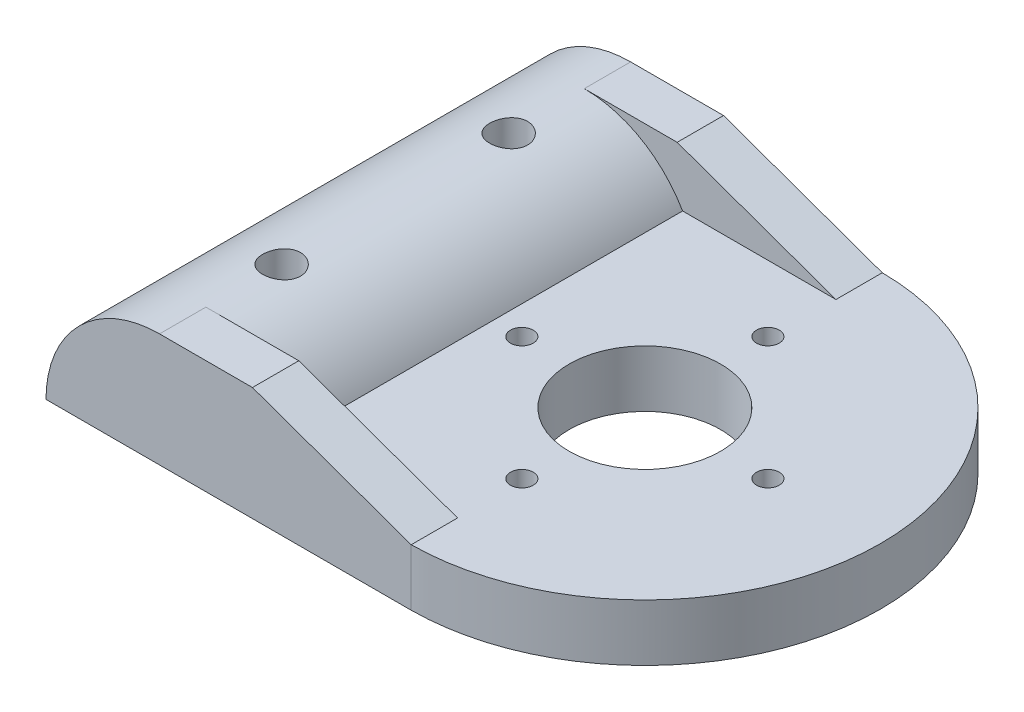
ISO-10303-21;
HEADER;
FILE_DESCRIPTION(('STEP AP214'),'2;1');
FILE_NAME('part.step','',(''),(''),'','','');
FILE_SCHEMA(('AUTOMOTIVE_DESIGN { 1 0 10303 214 1 1 1 1 }'));
ENDSEC;
DATA;
#1=APPLICATION_CONTEXT('core data for automotive mechanical design processes');
#2=APPLICATION_PROTOCOL_DEFINITION('international standard','automotive_design',2000,#1);
#3=PRODUCT_CONTEXT('',#1,'mechanical');
#4=PRODUCT('Part','Part','',(#3));
#5=PRODUCT_RELATED_PRODUCT_CATEGORY('part','',(#4));
#6=PRODUCT_DEFINITION_FORMATION('','',#4);
#7=PRODUCT_DEFINITION_CONTEXT('part definition',#1,'design');
#8=PRODUCT_DEFINITION('design','',#6,#7);
#9=PRODUCT_DEFINITION_SHAPE('','',#8);
#10=(LENGTH_UNIT() NAMED_UNIT(*) SI_UNIT(.MILLI.,.METRE.));
#11=(NAMED_UNIT(*) PLANE_ANGLE_UNIT() SI_UNIT($,.RADIAN.));
#12=(NAMED_UNIT(*) SI_UNIT($,.STERADIAN.) SOLID_ANGLE_UNIT());
#13=UNCERTAINTY_MEASURE_WITH_UNIT(LENGTH_MEASURE(1.E-05),#10,'distance_accuracy_value','');
#14=(GEOMETRIC_REPRESENTATION_CONTEXT(3) GLOBAL_UNCERTAINTY_ASSIGNED_CONTEXT((#13)) GLOBAL_UNIT_ASSIGNED_CONTEXT((#10,
#11,#12)) REPRESENTATION_CONTEXT('',''));
#15=CARTESIAN_POINT('',(0.,0.,0.));
#16=DIRECTION('',(0.,0.,1.));
#17=DIRECTION('',(1.,0.,0.));
#18=AXIS2_PLACEMENT_3D('',#15,#16,#17);
#19=CARTESIAN_POINT('',(4.11917536426009,3.,0.372218896237082));
#20=DIRECTION('',(0.,1.,0.));
#21=DIRECTION('',(0.,0.,1.));
#22=AXIS2_PLACEMENT_3D('',#19,#20,#21);
#23=PLANE('',#22);
#24=CARTESIAN_POINT('',(4.11842239450041,3.,-6.1284034925885));
#25=DIRECTION('',(0.,1.,0.));
#26=DIRECTION('',(0.,0.,1.));
#27=AXIS2_PLACEMENT_3D('',#24,#25,#26);
#28=CIRCLE('',#27,0.599999867802697);
#29=CARTESIAN_POINT('',(4.11842239450041,3.,-5.5284036247858));
#30=VERTEX_POINT('',#29);
#31=EDGE_CURVE('E189',#30,#30,#28,.T.);
#32=ORIENTED_EDGE('',*,*,#31,.F.);
#33=EDGE_LOOP('',(#32));
#34=FACE_BOUND('',#33,.T.);
#35=CARTESIAN_POINT('',(4.11917536426009,3.,0.372218896237082));
#36=DIRECTION('',(0.,1.,0.));
#37=DIRECTION('',(0.,0.,1.));
#38=AXIS2_PLACEMENT_3D('',#35,#36,#37);
#39=CIRCLE('',#38,3.99942615782216);
#40=CARTESIAN_POINT('',(4.11917536426009,3.,4.37164505405924));
#41=VERTEX_POINT('',#40);
#42=EDGE_CURVE('E197',#41,#41,#39,.T.);
#43=ORIENTED_EDGE('',*,*,#42,.F.);
#44=EDGE_LOOP('',(#43));
#45=FACE_BOUND('',#44,.T.);
#46=CARTESIAN_POINT('',(4.12064230010196,3.,6.87395746927739));
#47=DIRECTION('',(0.,1.,0.));
#48=DIRECTION('',(0.,0.,1.));
#49=AXIS2_PLACEMENT_3D('',#46,#47,#48);
#50=CIRCLE('',#49,0.599999867802697);
#51=CARTESIAN_POINT('',(4.12064230010196,3.,7.47395733708009));
#52=VERTEX_POINT('',#51);
#53=EDGE_CURVE('E165',#52,#52,#50,.T.);
#54=ORIENTED_EDGE('',*,*,#53,.F.);
#55=EDGE_LOOP('',(#54));
#56=FACE_BOUND('',#55,.T.);
#57=DIRECTION('',(0.,0.,-1.));
#58=VECTOR('',#57,1.);
#59=CARTESIAN_POINT('',(4.21842255479832,3.,-12.0752609670835));
#60=LINE('',#59,#58);
#61=CARTESIAN_POINT('',(4.21842255479832,3.,-9.62526096708351));
#62=VERTEX_POINT('',#61);
#63=CARTESIAN_POINT('',(4.21842255479832,3.,-12.0752609670835));
#64=VERTEX_POINT('',#63);
#65=EDGE_CURVE('E243',#62,#64,#60,.T.);
#66=ORIENTED_EDGE('',*,*,#65,.F.);
#67=DIRECTION('',(1.,0.,0.));
#68=VECTOR('',#67,1.);
#69=CARTESIAN_POINT('',(4.21842255479832,3.,-9.62526096708351));
#70=LINE('',#69,#68);
#71=CARTESIAN_POINT('',(-3.88542473638954,3.,-9.62526096708351));
#72=VERTEX_POINT('',#71);
#73=EDGE_CURVE('E242',#72,#62,#70,.T.);
#74=ORIENTED_EDGE('',*,*,#73,.F.);
#75=DIRECTION('',(0.,0.,1.));
#76=VECTOR('',#75,1.);
#77=CARTESIAN_POINT('',(-3.88542473638954,3.,-22.8919147934755));
#78=LINE('',#77,#76);
#79=CARTESIAN_POINT('',(-3.88542473638954,3.,10.3696987595577));
#80=VERTEX_POINT('',#79);
#81=EDGE_CURVE('E137',#72,#80,#78,.T.);
#82=ORIENTED_EDGE('',*,*,#81,.T.);
#83=DIRECTION('',(-1.,0.,0.));
#84=VECTOR('',#83,1.);
#85=CARTESIAN_POINT('',(4.21842255479832,3.,10.3696987595577));
#86=LINE('',#85,#84);
#87=CARTESIAN_POINT('',(4.21842255479832,3.,10.3696987595577));
#88=VERTEX_POINT('',#87);
#89=EDGE_CURVE('E146',#88,#80,#86,.T.);
#90=ORIENTED_EDGE('',*,*,#89,.F.);
#91=DIRECTION('',(0.,0.,-1.));
#92=VECTOR('',#91,1.);
#93=CARTESIAN_POINT('',(4.21842255479832,3.,12.8196987595577));
#94=LINE('',#93,#92);
#95=CARTESIAN_POINT('',(4.21842255479832,3.,12.8196987595577));
#96=VERTEX_POINT('',#95);
#97=EDGE_CURVE('E143',#96,#88,#94,.T.);
#98=ORIENTED_EDGE('',*,*,#97,.F.);
#99=CARTESIAN_POINT('',(4.11917536426009,3.,0.372218896237082));
#100=DIRECTION('',(0.,1.,0.));
#101=DIRECTION('',(0.,0.,1.));
#102=AXIS2_PLACEMENT_3D('',#99,#100,#101);
#103=CIRCLE('',#102,12.447875519646);
#104=EDGE_CURVE('E205',#96,#64,#103,.T.);
#105=ORIENTED_EDGE('',*,*,#104,.T.);
#106=EDGE_LOOP('',(#66,#74,#82,#90,#98,#105));
#107=FACE_BOUND('',#106,.T.);
#108=CARTESIAN_POINT('',(-2.38164813363174,3.,0.373886941145171));
#109=DIRECTION('',(0.,1.,0.));
#110=DIRECTION('',(0.,0.,1.));
#111=AXIS2_PLACEMENT_3D('',#108,#109,#110);
#112=CIRCLE('',#111,0.599999867802697);
#113=CARTESIAN_POINT('',(-2.38164813363174,3.,0.973886808947868));
#114=VERTEX_POINT('',#113);
#115=EDGE_CURVE('E157',#114,#114,#112,.T.);
#116=ORIENTED_EDGE('',*,*,#115,.F.);
#117=EDGE_LOOP('',(#116));
#118=FACE_BOUND('',#117,.T.);
#119=CARTESIAN_POINT('',(10.6207128282342,3.,0.371667035543671));
#120=DIRECTION('',(0.,1.,0.));
#121=DIRECTION('',(0.,0.,1.));
#122=AXIS2_PLACEMENT_3D('',#119,#120,#121);
#123=CIRCLE('',#122,0.599999867802698);
#124=CARTESIAN_POINT('',(10.6207128282342,3.,0.971666903346369));
#125=VERTEX_POINT('',#124);
#126=EDGE_CURVE('E173',#125,#125,#123,.T.);
#127=ORIENTED_EDGE('',*,*,#126,.F.);
#128=EDGE_LOOP('',(#127));
#129=FACE_BOUND('',#128,.T.);
#130=ADVANCED_FACE('F39',(#34,#45,#56,#107,#118,#129),#23,.T.);
#131=CARTESIAN_POINT('',(-9.08157715909618,0.,-22.8919147934755));
#132=DIRECTION('',(0.,0.,1.));
#133=DIRECTION('',(1.,0.,0.));
#134=AXIS2_PLACEMENT_3D('',#131,#132,#133);
#135=CYLINDRICAL_SURFACE('',#134,6.);
#136=CARTESIAN_POINT('',(-9.08157736726677,6.,-6.62840351469082));
#137=CARTESIAN_POINT('',(-9.13733373608122,5.9999990427406,-6.62840127911144));
#138=CARTESIAN_POINT('',(-9.19312053363991,5.9992147075897,-6.62372460412152));
#139=CARTESIAN_POINT('',(-9.30312948293314,5.99616137113838,-6.60514924832354));
#140=CARTESIAN_POINT('',(-9.35735014800049,5.99389100463113,-6.59124208736609));
#141=CARTESIAN_POINT('',(-9.4626193123622,5.98812025681556,-6.55463732626242));
#142=CARTESIAN_POINT('',(-9.5136703669585,5.98462088187845,-6.53194691671398));
#143=CARTESIAN_POINT('',(-9.6112341680315,5.97677688426047,-6.47843857974568));
#144=CARTESIAN_POINT('',(-9.6577474327377,5.97243235826851,-6.44762158189909));
#145=CARTESIAN_POINT('',(-9.74536649314108,5.96333323778109,-6.3784214509825));
#146=CARTESIAN_POINT('',(-9.78642261390057,5.95857545258506,-6.3399758339112));
#147=CARTESIAN_POINT('',(-9.8615328612073,5.94921046786042,-6.25674428206739));
#148=CARTESIAN_POINT('',(-9.89558654569421,5.94460327785425,-6.21195794730969));
#149=CARTESIAN_POINT('',(-9.95592432358438,5.93603021677279,-6.11697506558181));
#150=CARTESIAN_POINT('',(-9.98215929769411,5.93206846818264,-6.06674691106923));
#151=CARTESIAN_POINT('',(-10.0258008280066,5.92527910775825,-5.96251960701163));
#152=CARTESIAN_POINT('',(-10.043207980554,5.9224514193177,-5.90852071247131));
#153=CARTESIAN_POINT('',(-10.0685432378852,5.91828209272935,-5.79881130260128));
#154=CARTESIAN_POINT('',(-10.0765570992656,5.91692701870042,-5.74312111135401));
#155=CARTESIAN_POINT('',(-10.0831441783145,5.91581570002871,-5.6311712819635));
#156=CARTESIAN_POINT('',(-10.0817180641015,5.91605934223605,-5.57491168440165));
#157=CARTESIAN_POINT('',(-10.0695355257645,5.91810566081447,-5.46403222883277));
#158=CARTESIAN_POINT('',(-10.0588754379436,5.91989223944691,-5.4094014458394));
#159=CARTESIAN_POINT('',(-10.0286787380208,5.92479792925377,-5.30271482825528));
#160=CARTESIAN_POINT('',(-10.0091418214774,5.92791708613035,-5.25065908204645));
#161=CARTESIAN_POINT('',(-9.96164837307206,5.93515387055943,-5.15031180891748));
#162=CARTESIAN_POINT('',(-9.93365183715376,5.93927622361583,-5.10203957035188));
#163=CARTESIAN_POINT('',(-9.87006227177794,5.94805163316118,-5.01084156211466));
#164=CARTESIAN_POINT('',(-9.83446862920198,5.95270473246946,-4.96791622440345));
#165=CARTESIAN_POINT('',(-9.75617033709956,5.96208807838317,-4.88807287343402));
#166=CARTESIAN_POINT('',(-9.71338303283066,5.96681856645433,-4.85123589572029));
#167=CARTESIAN_POINT('',(-9.62219153625131,5.97577038051896,-4.78525218971124));
#168=CARTESIAN_POINT('',(-9.5737873077528,5.97999170323169,-4.75610551096604));
#169=CARTESIAN_POINT('',(-9.47265978530612,5.98745555465989,-4.70632239358313));
#170=CARTESIAN_POINT('',(-9.41993290256392,5.99069725938861,-4.68569311387927));
#171=CARTESIAN_POINT('',(-9.3116967371205,5.99583000290953,-4.65360559102985));
#172=CARTESIAN_POINT('',(-9.25618768759404,5.99772115469032,-4.64214658068079));
#173=CARTESIAN_POINT('',(-9.14466133857459,5.9999245171317,-4.62883473005876));
#174=CARTESIAN_POINT('',(-9.08865766601041,6.00025501186507,-4.62687064430186));
#175=CARTESIAN_POINT('',(-8.97712144816774,5.99934990120014,-4.63230781115083));
#176=CARTESIAN_POINT('',(-8.92158888484448,5.99811435606057,-4.63970870340726));
#177=CARTESIAN_POINT('',(-8.81291486694258,5.99422731579138,-4.66357321653672));
#178=CARTESIAN_POINT('',(-8.75976098347501,5.99158442848139,-4.67998176196736));
#179=CARTESIAN_POINT('',(-8.65695856459338,5.98517786918527,-4.72133709051649));
#180=CARTESIAN_POINT('',(-8.60731022621415,5.98141413426203,-4.74628435310729));
#181=CARTESIAN_POINT('',(-8.5124450254786,5.97313807880032,-4.80426374244933));
#182=CARTESIAN_POINT('',(-8.46727119553224,5.96861943766409,-4.83736535872793));
#183=CARTESIAN_POINT('',(-8.3830798516592,5.95935388446091,-4.91061823059262));
#184=CARTESIAN_POINT('',(-8.34406278529402,5.95460695583146,-4.95076999823655));
#185=CARTESIAN_POINT('',(-8.27288016058081,5.94536071638776,-5.03748233796851));
#186=CARTESIAN_POINT('',(-8.24078976398503,5.9408644800387,-5.08410499029549));
#187=CARTESIAN_POINT('',(-8.18489633722473,5.9326861345821,-5.18214452301921));
#188=CARTESIAN_POINT('',(-8.16109304436066,5.92900399966905,-5.23356125137917));
#189=CARTESIAN_POINT('',(-8.1225619204819,5.92289383001558,-5.33951924686048));
#190=CARTESIAN_POINT('',(-8.10779667795918,5.92046063235937,-5.39404659828208));
#191=CARTESIAN_POINT('',(-8.08764306641452,5.91711088226498,-5.50485142528434));
#192=CARTESIAN_POINT('',(-8.08225388218765,5.91619419797332,-5.56112874827995));
#193=CARTESIAN_POINT('',(-8.08102809979169,5.91598694706944,-5.67308546044099));
#194=CARTESIAN_POINT('',(-8.08507319196799,5.91667624073078,-5.72876355236291));
#195=CARTESIAN_POINT('',(-8.10234531241231,5.91955914052197,-5.83863511377483));
#196=CARTESIAN_POINT('',(-8.11557231091962,5.92175274177599,-5.89282858807622));
#197=CARTESIAN_POINT('',(-8.15078745738631,5.92738943991369,-5.99814680936672));
#198=CARTESIAN_POINT('',(-8.1727654194716,5.93083108369689,-6.04927504487816));
#199=CARTESIAN_POINT('',(-8.22484646017482,5.9385774905101,-6.14713772084181));
#200=CARTESIAN_POINT('',(-8.25494994178369,5.94288229634654,-6.19387194321477));
#201=CARTESIAN_POINT('',(-8.32284971957088,5.95193383076611,-6.28221770343301));
#202=CARTESIAN_POINT('',(-8.36073305237636,5.95668519670549,-6.32376188209327));
#203=CARTESIAN_POINT('',(-8.44293367508654,5.96605750323686,-6.39994412682161));
#204=CARTESIAN_POINT('',(-8.4872524478043,5.9706784134762,-6.43458059688215));
#205=CARTESIAN_POINT('',(-8.58142963633742,5.97930613074916,-6.49618280445517));
#206=CARTESIAN_POINT('',(-8.63132419506096,5.98330847642638,-6.52309391627335));
#207=CARTESIAN_POINT('',(-8.73497209455947,5.99020467990322,-6.56811130010541));
#208=CARTESIAN_POINT('',(-8.78872153073509,5.99309964105489,-6.58622634103439));
#209=CARTESIAN_POINT('',(-8.88249601638448,5.99682316938469,-6.60920562147432));
#210=CARTESIAN_POINT('',(-8.92195381361409,5.99800811409579,-6.6163933007455));
#211=CARTESIAN_POINT('',(-9.00146163234133,5.99959686661552,-6.62599300947068));
#212=CARTESIAN_POINT('',(-9.04151164363081,6.00000068787281,-6.62840512114596));
#213=CARTESIAN_POINT('',(-9.08157736726677,6.,-6.62840351469082));
#214=B_SPLINE_CURVE_WITH_KNOTS('',3,(#136,#137,#138,#139,#140,#141,#142,#143,#144,#145,#146,
#147,#148,#149,#150,#151,#152,#153,#154,#155,#156,#157,#158,#159,#160,#161,#162,#163,#164,#165,
#166,#167,#168,#169,#170,#171,#172,#173,#174,#175,#176,#177,#178,#179,#180,#181,#182,#183,#184,
#185,#186,#187,#188,#189,#190,#191,#192,#193,#194,#195,#196,#197,#198,#199,#200,#201,#202,#203,
#204,#205,#206,#207,#208,#209,#210,#211,#212,#213),.UNSPECIFIED.,.T.,.F.,(4,2,2,2,2,2,2,2,2,2,2,
2,2,2,2,2,2,2,2,2,2,2,2,2,2,2,2,2,2,2,2,2,2,2,2,2,2,2,4),(0.,0.167122654448334,
0.334399059242411,0.501538808208842,0.668659446905194,0.837210067389465,1.00577132512634,
1.17537022910613,1.34495767466871,1.51298449543574,1.68099942415514,1.84728231251463,
2.01357090417887,2.18065848977293,2.34775956513982,2.51693138287494,2.68610429059076,
2.8554191012779,3.02471974525996,3.1920319218123,3.35933766065431,3.52563165599521,
3.691934990731,3.85970776917,4.02749273811751,4.1970157938139,4.36653347517349,4.53534463549733,
4.70414111773744,4.87083222520226,5.03752279238489,5.20401990100976,5.37052526869543,
5.53900620579525,5.70752602498027,5.8772096359117,6.04672373800653,6.16681773830443,
6.28690967091786),.UNSPECIFIED.);
#215=CARTESIAN_POINT('',(-9.08157736726677,6.,-6.62840351469082));
#216=VERTEX_POINT('',#215);
#217=EDGE_CURVE('E281',#216,#216,#214,.T.);
#218=ORIENTED_EDGE('',*,*,#217,.F.);
#219=EDGE_LOOP('',(#218));
#220=FACE_BOUND('',#219,.T.);
#221=CARTESIAN_POINT('',(-9.08157658468094,5.99999999999997,5.3715961947882));
#222=CARTESIAN_POINT('',(-9.13733297233239,5.99999905001255,5.37159843036785));
#223=CARTESIAN_POINT('',(-9.19311978882885,5.99921472160821,5.37627510685072));
#224=CARTESIAN_POINT('',(-9.30312877565598,5.99616139744235,5.39485046866601));
#225=CARTESIAN_POINT('',(-9.35734945931987,5.99389103647353,5.40875763414646));
#226=CARTESIAN_POINT('',(-9.46261865997638,5.98812029848601,5.44536240724483));
#227=CARTESIAN_POINT('',(-9.51366973227048,5.98462092783906,5.46805282426587));
#228=CARTESIAN_POINT('',(-9.61123356730954,5.97677693763232,5.5215611789201));
#229=CARTESIAN_POINT('',(-9.65774684828365,5.97243241476147,5.55237818698059));
#230=CARTESIAN_POINT('',(-9.74536593936962,5.96333329953383,5.62157834077953));
#231=CARTESIAN_POINT('',(-9.78642207454079,5.95857551646859,5.66002397052358));
#232=CARTESIAN_POINT('',(-9.86153234841903,5.94921053517089,5.74325554979039));
#233=CARTESIAN_POINT('',(-9.89558604506536,5.94460334646082,5.78804189929871));
#234=CARTESIAN_POINT('',(-9.95592384518079,5.93603028729647,5.88302481288563));
#235=CARTESIAN_POINT('',(-9.98215882924281,5.93206853933167,5.93325298458005));
#236=CARTESIAN_POINT('',(-10.0258003764688,5.92527917974416,6.0374803243586));
#237=CARTESIAN_POINT('',(-10.0432075359767,5.92245149151527,6.09147923743829));
#238=CARTESIAN_POINT('',(-10.068542804206,5.91828216506399,6.20118868586709));
#239=CARTESIAN_POINT('',(-10.0765566694207,5.91692709098351,6.25687889715708));
#240=CARTESIAN_POINT('',(-10.0831437526753,5.91581577209203,6.36882876698738));
#241=CARTESIAN_POINT('',(-10.0817176388336,5.91605941413123,6.4250883849463));
#242=CARTESIAN_POINT('',(-10.0695350977381,5.91810573226979,6.53596788121998));
#243=CARTESIAN_POINT('',(-10.0588750067668,5.91989231064104,6.59059868451695));
#244=CARTESIAN_POINT('',(-10.0286782971003,5.92479799974873,6.6972853419014));
#245=CARTESIAN_POINT('',(-10.0091413739633,5.92791715618732,6.74934110760693));
#246=CARTESIAN_POINT('',(-9.96164790913384,5.935153939385,6.84968841828107));
#247=CARTESIAN_POINT('',(-9.93365136339652,5.9392762916431,6.89796067490171));
#248=CARTESIAN_POINT('',(-9.8700617753863,5.94805169902327,6.98915871735049));
#249=CARTESIAN_POINT('',(-9.83446811999507,5.95270479696459,7.03208407121831));
#250=CARTESIAN_POINT('',(-9.75616979987444,5.96208813925867,7.1119274518468));
#251=CARTESIAN_POINT('',(-9.71338248044372,5.9668186250668,7.14876444310565));
#252=CARTESIAN_POINT('',(-9.62219095142212,5.9757704335485,7.21474817345299));
#253=CARTESIAN_POINT('',(-9.57378670564376,5.97999175294135,7.24389486299215));
#254=CARTESIAN_POINT('',(-9.47265914775692,5.9874555964468,7.29367799852123));
#255=CARTESIAN_POINT('',(-9.41993224691304,5.99069729658537,7.31430728569429));
#256=CARTESIAN_POINT('',(-9.31169604437744,5.99583002966188,7.3463948204096));
#257=CARTESIAN_POINT('',(-9.25618697586068,5.99772117558859,7.35785383515606));
#258=CARTESIAN_POINT('',(-9.14466058903947,5.9999245251837,7.37116569136986));
#259=CARTESIAN_POINT('',(-9.08865689767237,6.00025501294583,7.37312977839949));
#260=CARTESIAN_POINT('',(-8.97712064246112,5.99934988734611,7.36769261117558));
#261=CARTESIAN_POINT('',(-8.92158806057223,5.99811433424288,7.36029171727086));
#262=CARTESIAN_POINT('',(-8.8129140055784,5.99422727735807,7.33642719792459));
#263=CARTESIAN_POINT('',(-8.75976010360858,5.99158438138093,7.32001864781743));
#264=CARTESIAN_POINT('',(-8.65695764884541,5.98517780437647,7.27866330712663));
#265=CARTESIAN_POINT('',(-8.60730929308741,5.98141406041188,7.25371603706939));
#266=CARTESIAN_POINT('',(-8.51244405785902,5.97313798675231,7.19573662949714));
#267=CARTESIAN_POINT('',(-8.46727021091906,5.96861933644426,7.16263500225809));
#268=CARTESIAN_POINT('',(-8.38307883513181,5.95935376543327,7.08938210575698));
#269=CARTESIAN_POINT('',(-8.34406175384668,5.95460682816785,7.04923032443629));
#270=CARTESIAN_POINT('',(-8.27287910133201,5.94536057239852,6.96251795443819));
#271=CARTESIAN_POINT('',(-8.24078869193604,5.94086432837319,6.91589528545045));
#272=CARTESIAN_POINT('',(-8.18489524261753,5.9326859691985,6.81785571724448));
#273=CARTESIAN_POINT('',(-8.16109193999431,5.92900382824347,6.76643897006368));
#274=CARTESIAN_POINT('',(-8.12256080044201,5.92289364868983,6.66048093643553));
#275=CARTESIAN_POINT('',(-8.10779555181642,5.92046044714262,6.60595356575945));
#276=CARTESIAN_POINT('',(-8.08764193140258,5.91711069161835,6.49514869937098));
#277=CARTESIAN_POINT('',(-8.08225274440723,5.9161940057873,6.43887135624408));
#278=CARTESIAN_POINT('',(-8.08102695996288,5.91598675429428,6.32691460545372));
#279=CARTESIAN_POINT('',(-8.08507205255502,5.91667604883061,6.27123649503886));
#280=CARTESIAN_POINT('',(-8.10234417664117,5.91955895264215,6.16136489701214));
#281=CARTESIAN_POINT('',(-8.11557117837423,5.92175255704151,6.10717140458882));
#282=CARTESIAN_POINT('',(-8.15078633388022,5.9273892635023,6.00185314810113));
#283=CARTESIAN_POINT('',(-8.17276430174747,5.93083091245682,5.95072489550367));
#284=CARTESIAN_POINT('',(-8.22484535638746,5.93857733130613,5.85286218654973));
#285=CARTESIAN_POINT('',(-8.25494884615241,5.94288214400753,5.80612794827319));
#286=CARTESIAN_POINT('',(-8.32284864337415,5.95193369364123,5.71778215640254));
#287=CARTESIAN_POINT('',(-8.36073198767004,5.95668506795499,5.67623796215472));
#288=CARTESIAN_POINT('',(-8.44293263568055,5.96605739206632,5.60005568830989));
#289=CARTESIAN_POINT('',(-8.48725142220949,5.97067831151141,5.56541920472168));
#290=CARTESIAN_POINT('',(-8.58142864170395,5.97930604768563,5.503816971585));
#291=CARTESIAN_POINT('',(-8.63132321772286,5.9833084030444,5.47690584794486));
#292=CARTESIAN_POINT('',(-8.73497115376281,5.99020462562986,5.43188844360965));
#293=CARTESIAN_POINT('',(-8.78872060918349,5.99309959620856,5.41377339399841));
#294=CARTESIAN_POINT('',(-8.88249513390895,5.99682314021435,5.39079410048573));
#295=CARTESIAN_POINT('',(-8.92195295075522,5.99800809126548,5.38360641655376));
#296=CARTESIAN_POINT('',(-9.00146080929883,5.99959685575764,5.37400670158794));
#297=CARTESIAN_POINT('',(-9.04151084078799,6.00000068264737,5.37159458833259));
#298=CARTESIAN_POINT('',(-9.08157658468094,5.99999999999997,5.3715961947882));
#299=B_SPLINE_CURVE_WITH_KNOTS('',3,(#221,#222,#223,#224,#225,#226,#227,#228,#229,#230,#231,
#232,#233,#234,#235,#236,#237,#238,#239,#240,#241,#242,#243,#244,#245,#246,#247,#248,#249,#250,
#251,#252,#253,#254,#255,#256,#257,#258,#259,#260,#261,#262,#263,#264,#265,#266,#267,#268,#269,
#270,#271,#272,#273,#274,#275,#276,#277,#278,#279,#280,#281,#282,#283,#284,#285,#286,#287,#288,
#289,#290,#291,#292,#293,#294,#295,#296,#297,#298),.UNSPECIFIED.,.T.,.F.,(4,2,2,2,2,2,2,2,2,2,2,
2,2,2,2,2,2,2,2,2,2,2,2,2,2,2,2,2,2,2,2,2,2,2,2,2,2,2,4),(0.,0.167122710888112,
0.334399172098372,0.50153897749787,0.6686596726389,0.837210349672201,1.00577166396795,
1.17537062691716,1.34495813146067,1.51298501308043,1.68100000265569,1.84728295225882,
2.01357160516857,2.18065925175656,2.34776038811393,2.51693226575142,2.68610523335264,
2.85542010160611,3.02472080314166,3.19203303582203,3.35933883080317,3.52563288424209,
3.69193627710146,3.85970911783555,4.02749414909651,4.19701726903559,4.36653501461495,
4.53534623559454,4.70414277845152,4.87083394109635,5.03752456345449,5.20402172664908,
5.37052714893028,5.53900814547336,5.70752802413462,5.87721169915303,6.04672586531099,
6.16681992631668,6.28691191963228),.UNSPECIFIED.);
#300=CARTESIAN_POINT('',(-9.08157658468094,5.99999999999997,5.3715961947882));
#301=VERTEX_POINT('',#300);
#302=EDGE_CURVE('E127',#301,#301,#299,.T.);
#303=ORIENTED_EDGE('',*,*,#302,.F.);
#304=EDGE_LOOP('',(#303));
#305=FACE_BOUND('',#304,.T.);
#306=DIRECTION('',(0.,0.,1.));
#307=VECTOR('',#306,1.);
#308=CARTESIAN_POINT('',(-9.08157715909618,6.,-12.0752609670835));
#309=LINE('',#308,#307);
#310=CARTESIAN_POINT('',(-9.08157715909618,6.,-12.0752609670835));
#311=VERTEX_POINT('',#310);
#312=CARTESIAN_POINT('',(-9.08157715909618,6.,-9.62526096708351));
#313=VERTEX_POINT('',#312);
#314=EDGE_CURVE('E252',#311,#313,#309,.T.);
#315=ORIENTED_EDGE('',*,*,#314,.F.);
#316=CARTESIAN_POINT('',(-9.08157715909618,0.,-12.0752609670835));
#317=DIRECTION('',(0.,0.,1.));
#318=DIRECTION('',(1.,0.,0.));
#319=AXIS2_PLACEMENT_3D('',#316,#317,#318);
#320=CIRCLE('',#319,6.);
#321=CARTESIAN_POINT('',(-15.0815771590962,0.,-12.0752609670835));
#322=VERTEX_POINT('',#321);
#323=EDGE_CURVE('E151',#322,#311,#320,.F.);
#324=ORIENTED_EDGE('',*,*,#323,.F.);
#325=DIRECTION('',(0.,0.,1.));
#326=VECTOR('',#325,1.);
#327=CARTESIAN_POINT('',(-15.0815771590962,0.,12.8196987595577));
#328=LINE('',#327,#326);
#329=CARTESIAN_POINT('',(-15.0815771590962,0.,12.8196987595577));
#330=VERTEX_POINT('',#329);
#331=EDGE_CURVE('E201',#322,#330,#328,.T.);
#332=ORIENTED_EDGE('',*,*,#331,.T.);
#333=CARTESIAN_POINT('',(-9.08157715909618,0.,12.8196987595577));
#334=DIRECTION('',(0.,0.,1.));
#335=DIRECTION('',(1.,0.,0.));
#336=AXIS2_PLACEMENT_3D('',#333,#334,#335);
#337=CIRCLE('',#336,6.);
#338=CARTESIAN_POINT('',(-9.08157715909617,6.,12.8196987595577));
#339=VERTEX_POINT('',#338);
#340=EDGE_CURVE('E133',#339,#330,#337,.T.);
#341=ORIENTED_EDGE('',*,*,#340,.F.);
#342=DIRECTION('',(0.,0.,1.));
#343=VECTOR('',#342,1.);
#344=CARTESIAN_POINT('',(-9.08157715909617,6.,12.8196987595577));
#345=LINE('',#344,#343);
#346=CARTESIAN_POINT('',(-9.08157715909618,6.,10.3696987595577));
#347=VERTEX_POINT('',#346);
#348=EDGE_CURVE('E131',#347,#339,#345,.T.);
#349=ORIENTED_EDGE('',*,*,#348,.F.);
#350=CARTESIAN_POINT('',(-9.08157715909618,0.,10.3696987595577));
#351=DIRECTION('',(0.,0.,1.));
#352=DIRECTION('',(1.,0.,0.));
#353=AXIS2_PLACEMENT_3D('',#350,#351,#352);
#354=CIRCLE('',#353,6.);
#355=EDGE_CURVE('E48',#347,#80,#354,.F.);
#356=ORIENTED_EDGE('',*,*,#355,.T.);
#357=ORIENTED_EDGE('',*,*,#81,.F.);
#358=CARTESIAN_POINT('',(-9.08157715909618,0.,-9.62526096708351));
#359=DIRECTION('',(0.,0.,-1.));
#360=DIRECTION('',(-1.,0.,0.));
#361=AXIS2_PLACEMENT_3D('',#358,#359,#360);
#362=CIRCLE('',#361,6.);
#363=EDGE_CURVE('E11',#72,#313,#362,.F.);
#364=ORIENTED_EDGE('',*,*,#363,.T.);
#365=EDGE_LOOP('',(#315,#324,#332,#341,#349,#356,#357,#364));
#366=FACE_BOUND('',#365,.T.);
#367=ADVANCED_FACE('F233',(#220,#305,#366),#135,.T.);
#368=CARTESIAN_POINT('',(4.11917536426009,0.,0.372218896237082));
#369=DIRECTION('',(0.,1.,0.));
#370=DIRECTION('',(0.,0.,1.));
#371=AXIS2_PLACEMENT_3D('',#368,#369,#370);
#372=PLANE('',#371);
#373=ORIENTED_EDGE('',*,*,#331,.F.);
#374=DIRECTION('',(-1.,0.,0.));
#375=VECTOR('',#374,1.);
#376=CARTESIAN_POINT('',(4.21842255479832,0.,-12.0752609670835));
#377=LINE('',#376,#375);
#378=CARTESIAN_POINT('',(4.21842255479832,0.,-12.0752609670835));
#379=VERTEX_POINT('',#378);
#380=EDGE_CURVE('E210',#379,#322,#377,.T.);
#381=ORIENTED_EDGE('',*,*,#380,.F.);
#382=CARTESIAN_POINT('',(4.11917536426009,0.,0.372218896237082));
#383=DIRECTION('',(0.,1.,0.));
#384=DIRECTION('',(0.,0.,1.));
#385=AXIS2_PLACEMENT_3D('',#382,#383,#384);
#386=CIRCLE('',#385,12.447875519646);
#387=CARTESIAN_POINT('',(4.21842255479832,0.,12.8196987595577));
#388=VERTEX_POINT('',#387);
#389=EDGE_CURVE('E217',#388,#379,#386,.T.);
#390=ORIENTED_EDGE('',*,*,#389,.F.);
#391=DIRECTION('',(1.,0.,0.));
#392=VECTOR('',#391,1.);
#393=CARTESIAN_POINT('',(4.21842255479832,0.,12.8196987595577));
#394=LINE('',#393,#392);
#395=EDGE_CURVE('E214',#330,#388,#394,.T.);
#396=ORIENTED_EDGE('',*,*,#395,.F.);
#397=EDGE_LOOP('',(#373,#381,#390,#396));
#398=FACE_BOUND('',#397,.T.);
#399=CARTESIAN_POINT('',(4.11917536426009,0.,0.372218896237082));
#400=DIRECTION('',(0.,1.,0.));
#401=DIRECTION('',(0.,0.,1.));
#402=AXIS2_PLACEMENT_3D('',#399,#400,#401);
#403=CIRCLE('',#402,3.99942615782216);
#404=CARTESIAN_POINT('',(4.11917536426009,0.,4.37164505405924));
#405=VERTEX_POINT('',#404);
#406=EDGE_CURVE('E193',#405,#405,#403,.T.);
#407=ORIENTED_EDGE('',*,*,#406,.T.);
#408=EDGE_LOOP('',(#407));
#409=FACE_BOUND('',#408,.T.);
#410=CARTESIAN_POINT('',(4.11842239450041,0.,-6.1284034925885));
#411=DIRECTION('',(0.,1.,0.));
#412=DIRECTION('',(0.,0.,1.));
#413=AXIS2_PLACEMENT_3D('',#410,#411,#412);
#414=CIRCLE('',#413,0.599999867802697);
#415=CARTESIAN_POINT('',(4.11842239450041,0.,-5.5284036247858));
#416=VERTEX_POINT('',#415);
#417=EDGE_CURVE('E188',#416,#416,#414,.T.);
#418=ORIENTED_EDGE('',*,*,#417,.T.);
#419=EDGE_LOOP('',(#418));
#420=FACE_BOUND('',#419,.T.);
#421=CARTESIAN_POINT('',(-9.08157736726677,0.,-5.62840339394417));
#422=DIRECTION('',(0.,1.,0.));
#423=DIRECTION('',(0.,0.,1.));
#424=AXIS2_PLACEMENT_3D('',#421,#422,#423);
#425=CIRCLE('',#424,1.00000012074665);
#426=CARTESIAN_POINT('',(-9.08157736726677,0.,-4.62840327319752));
#427=VERTEX_POINT('',#426);
#428=EDGE_CURVE('E184',#427,#427,#425,.T.);
#429=ORIENTED_EDGE('',*,*,#428,.T.);
#430=EDGE_LOOP('',(#429));
#431=FACE_BOUND('',#430,.T.);
#432=CARTESIAN_POINT('',(-9.08157658468094,0.,6.37159667194882));
#433=DIRECTION('',(0.,1.,0.));
#434=DIRECTION('',(0.,0.,1.));
#435=AXIS2_PLACEMENT_3D('',#432,#433,#434);
#436=CIRCLE('',#435,1.00000047716062);
#437=CARTESIAN_POINT('',(-9.08157658468094,0.,7.37159714910943));
#438=VERTEX_POINT('',#437);
#439=EDGE_CURVE('E177',#438,#438,#436,.T.);
#440=ORIENTED_EDGE('',*,*,#439,.T.);
#441=EDGE_LOOP('',(#440));
#442=FACE_BOUND('',#441,.T.);
#443=CARTESIAN_POINT('',(10.6207128282342,0.,0.371667035543671));
#444=DIRECTION('',(0.,1.,0.));
#445=DIRECTION('',(0.,0.,1.));
#446=AXIS2_PLACEMENT_3D('',#443,#444,#445);
#447=CIRCLE('',#446,0.599999867802698);
#448=CARTESIAN_POINT('',(10.6207128282342,0.,0.971666903346369));
#449=VERTEX_POINT('',#448);
#450=EDGE_CURVE('E169',#449,#449,#447,.T.);
#451=ORIENTED_EDGE('',*,*,#450,.T.);
#452=EDGE_LOOP('',(#451));
#453=FACE_BOUND('',#452,.T.);
#454=CARTESIAN_POINT('',(4.12064230010196,0.,6.87395746927739));
#455=DIRECTION('',(0.,1.,0.));
#456=DIRECTION('',(0.,0.,1.));
#457=AXIS2_PLACEMENT_3D('',#454,#455,#456);
#458=CIRCLE('',#457,0.599999867802697);
#459=CARTESIAN_POINT('',(4.12064230010196,0.,7.47395733708009));
#460=VERTEX_POINT('',#459);
#461=EDGE_CURVE('E161',#460,#460,#458,.T.);
#462=ORIENTED_EDGE('',*,*,#461,.T.);
#463=EDGE_LOOP('',(#462));
#464=FACE_BOUND('',#463,.T.);
#465=CARTESIAN_POINT('',(-2.38164813363174,0.,0.373886941145171));
#466=DIRECTION('',(0.,1.,0.));
#467=DIRECTION('',(0.,0.,1.));
#468=AXIS2_PLACEMENT_3D('',#465,#466,#467);
#469=CIRCLE('',#468,0.599999867802697);
#470=CARTESIAN_POINT('',(-2.38164813363174,0.,0.973886808947868));
#471=VERTEX_POINT('',#470);
#472=EDGE_CURVE('E153',#471,#471,#469,.T.);
#473=ORIENTED_EDGE('',*,*,#472,.T.);
#474=EDGE_LOOP('',(#473));
#475=FACE_BOUND('',#474,.T.);
#476=ADVANCED_FACE('F315',(#398,#409,#420,#431,#442,#453,#464,#475),#372,.F.);
#477=CARTESIAN_POINT('',(4.21842255479832,3.,12.8196987595577));
#478=DIRECTION('',(0.,0.,-1.));
#479=DIRECTION('',(-1.,0.,0.));
#480=AXIS2_PLACEMENT_3D('',#477,#478,#479);
#481=PLANE('',#480);
#482=DIRECTION('',(0.,-1.,0.));
#483=VECTOR('',#482,1.);
#484=CARTESIAN_POINT('',(4.21842255479832,3.,12.8196987595577));
#485=LINE('',#484,#483);
#486=EDGE_CURVE('E124',#96,#388,#485,.T.);
#487=ORIENTED_EDGE('',*,*,#486,.F.);
#488=DIRECTION('',(0.941614886789678,-0.336691854632781,0.));
#489=VECTOR('',#488,1.);
#490=CARTESIAN_POINT('',(-4.17157744520168,6.,12.8196987595577));
#491=LINE('',#490,#489);
#492=CARTESIAN_POINT('',(-4.17157744520168,6.,12.8196987595577));
#493=VERTEX_POINT('',#492);
#494=EDGE_CURVE('E110',#493,#96,#491,.T.);
#495=ORIENTED_EDGE('',*,*,#494,.F.);
#496=DIRECTION('',(1.,0.,0.));
#497=VECTOR('',#496,1.);
#498=CARTESIAN_POINT('',(4.21842255479832,6.,12.8196987595577));
#499=LINE('',#498,#497);
#500=EDGE_CURVE('E121',#339,#493,#499,.T.);
#501=ORIENTED_EDGE('',*,*,#500,.F.);
#502=ORIENTED_EDGE('',*,*,#340,.T.);
#503=ORIENTED_EDGE('',*,*,#395,.T.);
#504=EDGE_LOOP('',(#487,#495,#501,#502,#503));
#505=FACE_BOUND('',#504,.T.);
#506=ADVANCED_FACE('F41',(#505),#481,.F.);
#507=CARTESIAN_POINT('',(4.11917536426009,3.,0.372218896237082));
#508=DIRECTION('',(0.,-1.,0.));
#509=DIRECTION('',(0.,0.,-1.));
#510=AXIS2_PLACEMENT_3D('',#507,#508,#509);
#511=CYLINDRICAL_SURFACE('',#510,12.447875519646);
#512=ORIENTED_EDGE('',*,*,#389,.T.);
#513=DIRECTION('',(0.,-1.,0.));
#514=VECTOR('',#513,1.);
#515=CARTESIAN_POINT('',(4.21842255479832,3.,-12.0752609670835));
#516=LINE('',#515,#514);
#517=EDGE_CURVE('E209',#64,#379,#516,.T.);
#518=ORIENTED_EDGE('',*,*,#517,.F.);
#519=ORIENTED_EDGE('',*,*,#104,.F.);
#520=ORIENTED_EDGE('',*,*,#486,.T.);
#521=EDGE_LOOP('',(#512,#518,#519,#520));
#522=FACE_BOUND('',#521,.T.);
#523=ADVANCED_FACE('F328',(#522),#511,.T.);
#524=CARTESIAN_POINT('',(4.21842255479832,3.,-12.0752609670835));
#525=DIRECTION('',(0.,0.,1.));
#526=DIRECTION('',(1.,0.,0.));
#527=AXIS2_PLACEMENT_3D('',#524,#525,#526);
#528=PLANE('',#527);
#529=DIRECTION('',(-1.,0.,0.));
#530=VECTOR('',#529,1.);
#531=CARTESIAN_POINT('',(4.21842255479832,6.,-12.0752609670835));
#532=LINE('',#531,#530);
#533=CARTESIAN_POINT('',(-4.17157744520168,6.,-12.0752609670835));
#534=VERTEX_POINT('',#533);
#535=EDGE_CURVE('E247',#534,#311,#532,.T.);
#536=ORIENTED_EDGE('',*,*,#535,.F.);
#537=DIRECTION('',(-0.941614886789678,0.336691854632781,0.));
#538=VECTOR('',#537,1.);
#539=CARTESIAN_POINT('',(-4.17157744520168,6.,-12.0752609670835));
#540=LINE('',#539,#538);
#541=EDGE_CURVE('E63',#64,#534,#540,.T.);
#542=ORIENTED_EDGE('',*,*,#541,.F.);
#543=ORIENTED_EDGE('',*,*,#517,.T.);
#544=ORIENTED_EDGE('',*,*,#380,.T.);
#545=ORIENTED_EDGE('',*,*,#323,.T.);
#546=EDGE_LOOP('',(#536,#542,#543,#544,#545));
#547=FACE_BOUND('',#546,.T.);
#548=ADVANCED_FACE('F326',(#547),#528,.F.);
#549=CARTESIAN_POINT('',(4.11917536426009,3.,0.372218896237082));
#550=DIRECTION('',(0.,-1.,0.));
#551=DIRECTION('',(0.,0.,-1.));
#552=AXIS2_PLACEMENT_3D('',#549,#550,#551);
#553=CYLINDRICAL_SURFACE('',#552,3.99942615782216);
#554=ORIENTED_EDGE('',*,*,#42,.T.);
#555=EDGE_LOOP('',(#554));
#556=FACE_BOUND('',#555,.T.);
#557=ORIENTED_EDGE('',*,*,#406,.F.);
#558=EDGE_LOOP('',(#557));
#559=FACE_BOUND('',#558,.T.);
#560=ADVANCED_FACE('F321',(#556,#559),#553,.F.);
#561=CARTESIAN_POINT('',(4.11842239450041,3.,-6.1284034925885));
#562=DIRECTION('',(0.,-1.,0.));
#563=DIRECTION('',(0.,0.,-1.));
#564=AXIS2_PLACEMENT_3D('',#561,#562,#563);
#565=CYLINDRICAL_SURFACE('',#564,0.599999867802697);
#566=ORIENTED_EDGE('',*,*,#31,.T.);
#567=EDGE_LOOP('',(#566));
#568=FACE_BOUND('',#567,.T.);
#569=ORIENTED_EDGE('',*,*,#417,.F.);
#570=EDGE_LOOP('',(#569));
#571=FACE_BOUND('',#570,.T.);
#572=ADVANCED_FACE('F370',(#568,#571),#565,.F.);
#573=CARTESIAN_POINT('',(-9.08157736726677,3.,-5.62840339394417));
#574=DIRECTION('',(0.,-1.,0.));
#575=DIRECTION('',(0.,0.,-1.));
#576=AXIS2_PLACEMENT_3D('',#573,#574,#575);
#577=CYLINDRICAL_SURFACE('',#576,1.00000012074665);
#578=ORIENTED_EDGE('',*,*,#428,.F.);
#579=EDGE_LOOP('',(#578));
#580=FACE_BOUND('',#579,.T.);
#581=ORIENTED_EDGE('',*,*,#217,.T.);
#582=EDGE_LOOP('',(#581));
#583=FACE_BOUND('',#582,.T.);
#584=ADVANCED_FACE('F365',(#580,#583),#577,.F.);
#585=CARTESIAN_POINT('',(-9.08157658468094,3.,6.37159667194882));
#586=DIRECTION('',(0.,-1.,0.));
#587=DIRECTION('',(0.,0.,-1.));
#588=AXIS2_PLACEMENT_3D('',#585,#586,#587);
#589=CYLINDRICAL_SURFACE('',#588,1.00000047716062);
#590=ORIENTED_EDGE('',*,*,#439,.F.);
#591=EDGE_LOOP('',(#590));
#592=FACE_BOUND('',#591,.T.);
#593=ORIENTED_EDGE('',*,*,#302,.T.);
#594=EDGE_LOOP('',(#593));
#595=FACE_BOUND('',#594,.T.);
#596=ADVANCED_FACE('F369',(#592,#595),#589,.F.);
#597=CARTESIAN_POINT('',(10.6207128282342,3.,0.371667035543671));
#598=DIRECTION('',(0.,-1.,0.));
#599=DIRECTION('',(0.,0.,-1.));
#600=AXIS2_PLACEMENT_3D('',#597,#598,#599);
#601=CYLINDRICAL_SURFACE('',#600,0.599999867802698);
#602=ORIENTED_EDGE('',*,*,#126,.T.);
#603=EDGE_LOOP('',(#602));
#604=FACE_BOUND('',#603,.T.);
#605=ORIENTED_EDGE('',*,*,#450,.F.);
#606=EDGE_LOOP('',(#605));
#607=FACE_BOUND('',#606,.T.);
#608=ADVANCED_FACE('F381',(#604,#607),#601,.F.);
#609=CARTESIAN_POINT('',(4.12064230010196,3.,6.87395746927739));
#610=DIRECTION('',(0.,-1.,0.));
#611=DIRECTION('',(0.,0.,-1.));
#612=AXIS2_PLACEMENT_3D('',#609,#610,#611);
#613=CYLINDRICAL_SURFACE('',#612,0.599999867802697);
#614=ORIENTED_EDGE('',*,*,#53,.T.);
#615=EDGE_LOOP('',(#614));
#616=FACE_BOUND('',#615,.T.);
#617=ORIENTED_EDGE('',*,*,#461,.F.);
#618=EDGE_LOOP('',(#617));
#619=FACE_BOUND('',#618,.T.);
#620=ADVANCED_FACE('F307',(#616,#619),#613,.F.);
#621=CARTESIAN_POINT('',(-2.38164813363174,3.,0.373886941145171));
#622=DIRECTION('',(0.,-1.,0.));
#623=DIRECTION('',(0.,0.,-1.));
#624=AXIS2_PLACEMENT_3D('',#621,#622,#623);
#625=CYLINDRICAL_SURFACE('',#624,0.599999867802697);
#626=ORIENTED_EDGE('',*,*,#115,.T.);
#627=EDGE_LOOP('',(#626));
#628=FACE_BOUND('',#627,.T.);
#629=ORIENTED_EDGE('',*,*,#472,.F.);
#630=EDGE_LOOP('',(#629));
#631=FACE_BOUND('',#630,.T.);
#632=ADVANCED_FACE('F303',(#628,#631),#625,.F.);
#633=CARTESIAN_POINT('',(4.21842255479832,6.,10.3696987595577));
#634=DIRECTION('',(0.,0.,1.));
#635=DIRECTION('',(1.,0.,0.));
#636=AXIS2_PLACEMENT_3D('',#633,#634,#635);
#637=PLANE('',#636);
#638=DIRECTION('',(-1.,0.,0.));
#639=VECTOR('',#638,1.);
#640=CARTESIAN_POINT('',(4.21842255479832,6.,10.3696987595577));
#641=LINE('',#640,#639);
#642=CARTESIAN_POINT('',(-4.17157744520168,6.,10.3696987595577));
#643=VERTEX_POINT('',#642);
#644=EDGE_CURVE('E139',#643,#347,#641,.T.);
#645=ORIENTED_EDGE('',*,*,#644,.F.);
#646=DIRECTION('',(0.941614886789678,-0.336691854632781,0.));
#647=VECTOR('',#646,1.);
#648=CARTESIAN_POINT('',(3.26732036704916,3.34008421492819,10.3696987595577));
#649=LINE('',#648,#647);
#650=EDGE_CURVE('E55',#643,#88,#649,.T.);
#651=ORIENTED_EDGE('',*,*,#650,.T.);
#652=ORIENTED_EDGE('',*,*,#89,.T.);
#653=ORIENTED_EDGE('',*,*,#355,.F.);
#654=EDGE_LOOP('',(#645,#651,#652,#653));
#655=FACE_BOUND('',#654,.T.);
#656=ADVANCED_FACE('F236',(#655),#637,.F.);
#657=CARTESIAN_POINT('',(0.,6.,0.));
#658=DIRECTION('',(0.,1.,0.));
#659=DIRECTION('',(0.,0.,1.));
#660=AXIS2_PLACEMENT_3D('',#657,#658,#659);
#661=PLANE('',#660);
#662=DIRECTION('',(0.,0.,1.));
#663=VECTOR('',#662,1.);
#664=CARTESIAN_POINT('',(-4.17157744520168,6.,-21.786655941858));
#665=LINE('',#664,#663);
#666=EDGE_CURVE('E107',#643,#493,#665,.T.);
#667=ORIENTED_EDGE('',*,*,#666,.F.);
#668=ORIENTED_EDGE('',*,*,#644,.T.);
#669=ORIENTED_EDGE('',*,*,#348,.T.);
#670=ORIENTED_EDGE('',*,*,#500,.T.);
#671=EDGE_LOOP('',(#667,#668,#669,#670));
#672=FACE_BOUND('',#671,.T.);
#673=ADVANCED_FACE('F129',(#672),#661,.T.);
#674=CARTESIAN_POINT('',(4.21842255479832,6.,-9.62526096708351));
#675=DIRECTION('',(0.,0.,-1.));
#676=DIRECTION('',(-1.,0.,0.));
#677=AXIS2_PLACEMENT_3D('',#674,#675,#676);
#678=PLANE('',#677);
#679=ORIENTED_EDGE('',*,*,#73,.T.);
#680=DIRECTION('',(-0.941614886789678,0.336691854632781,0.));
#681=VECTOR('',#680,1.);
#682=CARTESIAN_POINT('',(3.26732036704916,3.34008421492819,-9.62526096708351));
#683=LINE('',#682,#681);
#684=CARTESIAN_POINT('',(-4.17157744520168,6.,-9.62526096708351));
#685=VERTEX_POINT('',#684);
#686=EDGE_CURVE('E267',#62,#685,#683,.T.);
#687=ORIENTED_EDGE('',*,*,#686,.T.);
#688=DIRECTION('',(1.,0.,0.));
#689=VECTOR('',#688,1.);
#690=CARTESIAN_POINT('',(4.21842255479832,6.,-9.62526096708351));
#691=LINE('',#690,#689);
#692=EDGE_CURVE('E147',#313,#685,#691,.T.);
#693=ORIENTED_EDGE('',*,*,#692,.F.);
#694=ORIENTED_EDGE('',*,*,#363,.F.);
#695=EDGE_LOOP('',(#679,#687,#693,#694));
#696=FACE_BOUND('',#695,.T.);
#697=ADVANCED_FACE('F298',(#696),#678,.F.);
#698=CARTESIAN_POINT('',(0.,6.,0.));
#699=DIRECTION('',(0.,-1.,0.));
#700=DIRECTION('',(0.,0.,-1.));
#701=AXIS2_PLACEMENT_3D('',#698,#699,#700);
#702=PLANE('',#701);
#703=ORIENTED_EDGE('',*,*,#692,.T.);
#704=EDGE_CURVE('E116',#534,#685,#665,.T.);
#705=ORIENTED_EDGE('',*,*,#704,.F.);
#706=ORIENTED_EDGE('',*,*,#535,.T.);
#707=ORIENTED_EDGE('',*,*,#314,.T.);
#708=EDGE_LOOP('',(#703,#705,#706,#707));
#709=FACE_BOUND('',#708,.T.);
#710=ADVANCED_FACE('F295',(#709),#702,.F.);
#711=CARTESIAN_POINT('',(-4.17157744520168,6.,-21.786655941858));
#712=DIRECTION('',(-0.336691854632781,-0.941614886789678,0.));
#713=DIRECTION('',(0.941614886789678,-0.336691854632781,0.));
#714=AXIS2_PLACEMENT_3D('',#711,#712,#713);
#715=PLANE('',#714);
#716=ORIENTED_EDGE('',*,*,#65,.T.);
#717=ORIENTED_EDGE('',*,*,#541,.T.);
#718=ORIENTED_EDGE('',*,*,#704,.T.);
#719=ORIENTED_EDGE('',*,*,#686,.F.);
#720=EDGE_LOOP('',(#716,#717,#718,#719));
#721=FACE_BOUND('',#720,.T.);
#722=ADVANCED_FACE('F294',(#721),#715,.F.);
#723=ORIENTED_EDGE('',*,*,#666,.T.);
#724=ORIENTED_EDGE('',*,*,#494,.T.);
#725=ORIENTED_EDGE('',*,*,#97,.T.);
#726=ORIENTED_EDGE('',*,*,#650,.F.);
#727=EDGE_LOOP('',(#723,#724,#725,#726));
#728=FACE_BOUND('',#727,.T.);
#729=ADVANCED_FACE('F109',(#728),#715,.F.);
#730=CLOSED_SHELL('',(#130,#367,#476,#506,#523,#548,#560,#572,#584,#596,#608,#620,#632,#656,
#673,#697,#710,#722,#729));
#731=MANIFOLD_SOLID_BREP('B2',#730);
#732=ADVANCED_BREP_SHAPE_REPRESENTATION('',(#18,#731),#14);
#733=SHAPE_DEFINITION_REPRESENTATION(#9,#732);
ENDSEC;
END-ISO-10303-21;
